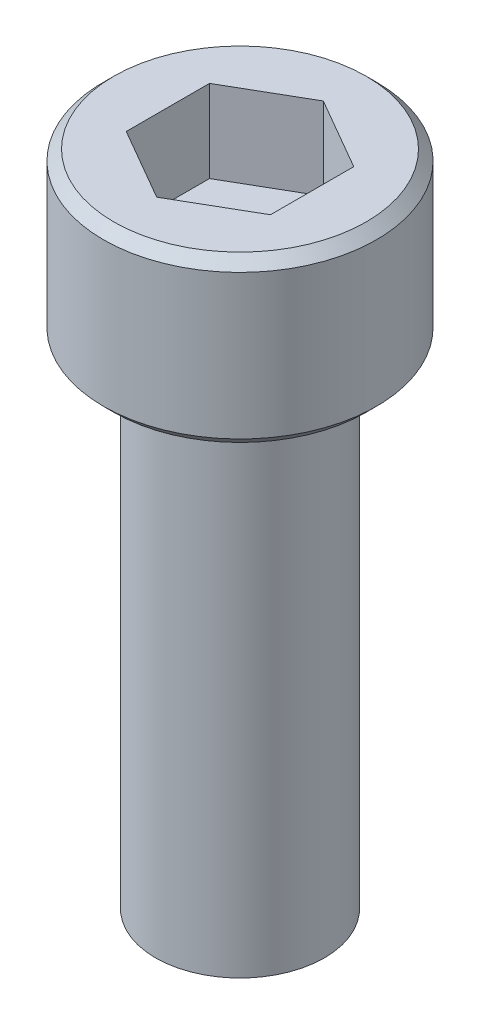
ISO-10303-21;
HEADER;
FILE_DESCRIPTION(('STEP AP214'),'2;1');
FILE_NAME('part.step','',(''),(''),'','','');
FILE_SCHEMA(('AUTOMOTIVE_DESIGN { 1 0 10303 214 1 1 1 1 }'));
ENDSEC;
DATA;
#1=APPLICATION_CONTEXT('core data for automotive mechanical design processes');
#2=APPLICATION_PROTOCOL_DEFINITION('international standard','automotive_design',2000,#1);
#3=PRODUCT_CONTEXT('',#1,'mechanical');
#4=PRODUCT('Part','Part','',(#3));
#5=PRODUCT_RELATED_PRODUCT_CATEGORY('part','',(#4));
#6=PRODUCT_DEFINITION_FORMATION('','',#4);
#7=PRODUCT_DEFINITION_CONTEXT('part definition',#1,'design');
#8=PRODUCT_DEFINITION('design','',#6,#7);
#9=PRODUCT_DEFINITION_SHAPE('','',#8);
#10=(LENGTH_UNIT() NAMED_UNIT(*) SI_UNIT(.MILLI.,.METRE.));
#11=(NAMED_UNIT(*) PLANE_ANGLE_UNIT() SI_UNIT($,.RADIAN.));
#12=(NAMED_UNIT(*) SI_UNIT($,.STERADIAN.) SOLID_ANGLE_UNIT());
#13=UNCERTAINTY_MEASURE_WITH_UNIT(LENGTH_MEASURE(1.E-05),#10,'distance_accuracy_value','');
#14=(GEOMETRIC_REPRESENTATION_CONTEXT(3) GLOBAL_UNCERTAINTY_ASSIGNED_CONTEXT((#13)) GLOBAL_UNIT_ASSIGNED_CONTEXT((#10,
#11,#12)) REPRESENTATION_CONTEXT('',''));
#15=CARTESIAN_POINT('',(0.,0.,0.));
#16=DIRECTION('',(0.,0.,1.));
#17=DIRECTION('',(1.,0.,0.));
#18=AXIS2_PLACEMENT_3D('',#15,#16,#17);
#19=CARTESIAN_POINT('',(1.778,2.03200000000001,3.07958633585744));
#20=DIRECTION('',(0.,1.,0.));
#21=DIRECTION('',(0.,0.,1.));
#22=AXIS2_PLACEMENT_3D('',#19,#20,#21);
#23=PLANE('',#22);
#24=DIRECTION('',(-0.866025403784439,0.,0.5));
#25=VECTOR('',#24,1.);
#26=CARTESIAN_POINT('',(0.,2.03200000000001,-2.05305755723829));
#27=LINE('',#26,#25);
#28=CARTESIAN_POINT('',(0.,2.03200000000001,-2.0530575572383));
#29=VERTEX_POINT('',#28);
#30=CARTESIAN_POINT('',(-1.778,2.03200000000001,-1.02652877861915));
#31=VERTEX_POINT('',#30);
#32=EDGE_CURVE('E67',#29,#31,#27,.T.);
#33=ORIENTED_EDGE('',*,*,#32,.T.);
#34=DIRECTION('',(0.,0.,1.));
#35=VECTOR('',#34,1.);
#36=CARTESIAN_POINT('',(-1.778,2.03200000000001,-1.02652877861915));
#37=LINE('',#36,#35);
#38=CARTESIAN_POINT('',(-1.778,2.03200000000001,1.02652877861915));
#39=VERTEX_POINT('',#38);
#40=EDGE_CURVE('E69',#31,#39,#37,.T.);
#41=ORIENTED_EDGE('',*,*,#40,.T.);
#42=DIRECTION('',(0.866025403784439,0.,0.499999999999999));
#43=VECTOR('',#42,1.);
#44=CARTESIAN_POINT('',(-1.77800000000001,2.03200000000001,1.02652877861915));
#45=LINE('',#44,#43);
#46=CARTESIAN_POINT('',(0.,2.03200000000001,2.05305755723831));
#47=VERTEX_POINT('',#46);
#48=EDGE_CURVE('E71',#39,#47,#45,.T.);
#49=ORIENTED_EDGE('',*,*,#48,.T.);
#50=DIRECTION('',(0.866025403784439,0.,-0.5));
#51=VECTOR('',#50,1.);
#52=CARTESIAN_POINT('',(0.,2.03200000000001,2.05305755723831));
#53=LINE('',#52,#51);
#54=CARTESIAN_POINT('',(1.77799999999999,2.03200000000001,1.02652877861915));
#55=VERTEX_POINT('',#54);
#56=EDGE_CURVE('E126',#47,#55,#53,.T.);
#57=ORIENTED_EDGE('',*,*,#56,.T.);
#58=DIRECTION('',(0.,0.,-1.));
#59=VECTOR('',#58,1.);
#60=CARTESIAN_POINT('',(1.77799999999999,2.03200000000001,1.02652877861915));
#61=LINE('',#60,#59);
#62=CARTESIAN_POINT('',(1.77799999999999,2.03200000000001,-1.02652877861916));
#63=VERTEX_POINT('',#62);
#64=EDGE_CURVE('E131',#55,#63,#61,.T.);
#65=ORIENTED_EDGE('',*,*,#64,.T.);
#66=DIRECTION('',(-0.866025403784439,0.,-0.5));
#67=VECTOR('',#66,1.);
#68=CARTESIAN_POINT('',(1.77799999999999,2.03200000000001,-1.02652877861916));
#69=LINE('',#68,#67);
#70=EDGE_CURVE('E135',#63,#29,#69,.T.);
#71=ORIENTED_EDGE('',*,*,#70,.T.);
#72=EDGE_LOOP('',(#33,#41,#49,#57,#65,#71));
#73=FACE_BOUND('',#72,.T.);
#74=ADVANCED_FACE('F16',(#73),#23,.T.);
#75=CARTESIAN_POINT('',(-1.77800000000001,2.03200000000001,1.02652877861915));
#76=DIRECTION('',(-0.499999999999999,0.,0.866025403784439));
#77=DIRECTION('',(0.866025403784439,0.,0.499999999999999));
#78=AXIS2_PLACEMENT_3D('',#75,#76,#77);
#79=PLANE('',#78);
#80=DIRECTION('',(0.,1.,0.));
#81=VECTOR('',#80,1.);
#82=CARTESIAN_POINT('',(0.,2.03200000000001,2.05305755723831));
#83=LINE('',#82,#81);
#84=CARTESIAN_POINT('',(0.,4.06400000000001,2.05305755723831));
#85=VERTEX_POINT('',#84);
#86=EDGE_CURVE('E82',#85,#47,#83,.F.);
#87=ORIENTED_EDGE('',*,*,#86,.T.);
#88=ORIENTED_EDGE('',*,*,#48,.F.);
#89=DIRECTION('',(0.,1.,0.));
#90=VECTOR('',#89,1.);
#91=CARTESIAN_POINT('',(-1.778,2.03200000000001,1.02652877861915));
#92=LINE('',#91,#90);
#93=CARTESIAN_POINT('',(-1.778,4.06400000000001,1.02652877861915));
#94=VERTEX_POINT('',#93);
#95=EDGE_CURVE('E76',#39,#94,#92,.T.);
#96=ORIENTED_EDGE('',*,*,#95,.T.);
#97=DIRECTION('',(-0.866025403784438,0.,-0.500000000000001));
#98=VECTOR('',#97,1.);
#99=CARTESIAN_POINT('',(0.,4.06400000000001,2.05305755723831));
#100=LINE('',#99,#98);
#101=EDGE_CURVE('E123',#85,#94,#100,.T.);
#102=ORIENTED_EDGE('',*,*,#101,.F.);
#103=EDGE_LOOP('',(#87,#88,#96,#102));
#104=FACE_BOUND('',#103,.T.);
#105=ADVANCED_FACE('F79',(#104),#79,.F.);
#106=CARTESIAN_POINT('',(-1.778,2.03200000000001,-1.02652877861915));
#107=DIRECTION('',(-1.,0.,0.));
#108=DIRECTION('',(0.,0.,1.));
#109=AXIS2_PLACEMENT_3D('',#106,#107,#108);
#110=PLANE('',#109);
#111=ORIENTED_EDGE('',*,*,#95,.F.);
#112=ORIENTED_EDGE('',*,*,#40,.F.);
#113=DIRECTION('',(0.,1.,0.));
#114=VECTOR('',#113,1.);
#115=CARTESIAN_POINT('',(-1.778,2.03200000000001,-1.02652877861914));
#116=LINE('',#115,#114);
#117=CARTESIAN_POINT('',(-1.778,4.06400000000001,-1.02652877861915));
#118=VERTEX_POINT('',#117);
#119=EDGE_CURVE('E90',#31,#118,#116,.T.);
#120=ORIENTED_EDGE('',*,*,#119,.T.);
#121=DIRECTION('',(0.,0.,1.));
#122=VECTOR('',#121,1.);
#123=CARTESIAN_POINT('',(-1.77800000000001,4.06400000000001,0.));
#124=LINE('',#123,#122);
#125=EDGE_CURVE('E87',#94,#118,#124,.F.);
#126=ORIENTED_EDGE('',*,*,#125,.F.);
#127=EDGE_LOOP('',(#111,#112,#120,#126));
#128=FACE_BOUND('',#127,.T.);
#129=ADVANCED_FACE('F85',(#128),#110,.F.);
#130=CARTESIAN_POINT('',(0.,2.03200000000001,-2.05305755723829));
#131=DIRECTION('',(-0.5,0.,-0.866025403784439));
#132=DIRECTION('',(-0.866025403784439,0.,0.5));
#133=AXIS2_PLACEMENT_3D('',#130,#131,#132);
#134=PLANE('',#133);
#135=ORIENTED_EDGE('',*,*,#119,.F.);
#136=ORIENTED_EDGE('',*,*,#32,.F.);
#137=DIRECTION('',(0.,1.,0.));
#138=VECTOR('',#137,1.);
#139=CARTESIAN_POINT('',(0.,2.03200000000001,-2.05305755723831));
#140=LINE('',#139,#138);
#141=CARTESIAN_POINT('',(0.,4.06400000000001,-2.0530575572383));
#142=VERTEX_POINT('',#141);
#143=EDGE_CURVE('E133',#29,#142,#140,.T.);
#144=ORIENTED_EDGE('',*,*,#143,.T.);
#145=DIRECTION('',(0.86602540378444,0.,-0.499999999999998));
#146=VECTOR('',#145,1.);
#147=CARTESIAN_POINT('',(-1.778,4.06400000000001,-1.02652877861915));
#148=LINE('',#147,#146);
#149=EDGE_CURVE('E119',#118,#142,#148,.T.);
#150=ORIENTED_EDGE('',*,*,#149,.F.);
#151=EDGE_LOOP('',(#135,#136,#144,#150));
#152=FACE_BOUND('',#151,.T.);
#153=ADVANCED_FACE('F138',(#152),#134,.F.);
#154=CARTESIAN_POINT('',(1.77799999999999,2.03200000000001,-1.02652877861916));
#155=DIRECTION('',(0.5,0.,-0.866025403784439));
#156=DIRECTION('',(-0.866025403784439,0.,-0.5));
#157=AXIS2_PLACEMENT_3D('',#154,#155,#156);
#158=PLANE('',#157);
#159=ORIENTED_EDGE('',*,*,#143,.F.);
#160=ORIENTED_EDGE('',*,*,#70,.F.);
#161=DIRECTION('',(0.,1.,0.));
#162=VECTOR('',#161,1.);
#163=CARTESIAN_POINT('',(1.77799999999999,2.03200000000001,-1.02652877861916));
#164=LINE('',#163,#162);
#165=CARTESIAN_POINT('',(1.77799999999999,4.06400000000001,-1.02652877861916));
#166=VERTEX_POINT('',#165);
#167=EDGE_CURVE('E129',#63,#166,#164,.T.);
#168=ORIENTED_EDGE('',*,*,#167,.T.);
#169=DIRECTION('',(0.866025403784443,0.,0.499999999999992));
#170=VECTOR('',#169,1.);
#171=CARTESIAN_POINT('',(0.,4.06400000000001,-2.05305755723829));
#172=LINE('',#171,#170);
#173=EDGE_CURVE('E116',#142,#166,#172,.T.);
#174=ORIENTED_EDGE('',*,*,#173,.F.);
#175=EDGE_LOOP('',(#159,#160,#168,#174));
#176=FACE_BOUND('',#175,.T.);
#177=ADVANCED_FACE('F150',(#176),#158,.F.);
#178=CARTESIAN_POINT('',(1.77799999999999,2.03200000000001,1.02652877861915));
#179=DIRECTION('',(1.,0.,0.));
#180=DIRECTION('',(0.,0.,-1.));
#181=AXIS2_PLACEMENT_3D('',#178,#179,#180);
#182=PLANE('',#181);
#183=ORIENTED_EDGE('',*,*,#167,.F.);
#184=ORIENTED_EDGE('',*,*,#64,.F.);
#185=DIRECTION('',(0.,1.,0.));
#186=VECTOR('',#185,1.);
#187=CARTESIAN_POINT('',(1.77799999999999,2.03200000000001,1.02652877861915));
#188=LINE('',#187,#186);
#189=CARTESIAN_POINT('',(1.77799999999999,4.06400000000001,1.02652877861915));
#190=VERTEX_POINT('',#189);
#191=EDGE_CURVE('E34',#55,#190,#188,.T.);
#192=ORIENTED_EDGE('',*,*,#191,.T.);
#193=DIRECTION('',(0.,0.,1.));
#194=VECTOR('',#193,1.);
#195=CARTESIAN_POINT('',(1.77799999999999,4.06400000000001,0.));
#196=LINE('',#195,#194);
#197=EDGE_CURVE('E113',#166,#190,#196,.T.);
#198=ORIENTED_EDGE('',*,*,#197,.F.);
#199=EDGE_LOOP('',(#183,#184,#192,#198));
#200=FACE_BOUND('',#199,.T.);
#201=ADVANCED_FACE('F148',(#200),#182,.F.);
#202=CARTESIAN_POINT('',(0.,2.03200000000001,2.05305755723831));
#203=DIRECTION('',(0.5,0.,0.866025403784439));
#204=DIRECTION('',(0.866025403784439,0.,-0.5));
#205=AXIS2_PLACEMENT_3D('',#202,#203,#204);
#206=PLANE('',#205);
#207=ORIENTED_EDGE('',*,*,#191,.F.);
#208=ORIENTED_EDGE('',*,*,#56,.F.);
#209=ORIENTED_EDGE('',*,*,#86,.F.);
#210=DIRECTION('',(-0.866025403784439,0.,0.499999999999999));
#211=VECTOR('',#210,1.);
#212=CARTESIAN_POINT('',(1.77799999999999,4.06400000000001,1.02652877861915));
#213=LINE('',#212,#211);
#214=EDGE_CURVE('E110',#190,#85,#213,.T.);
#215=ORIENTED_EDGE('',*,*,#214,.F.);
#216=EDGE_LOOP('',(#207,#208,#209,#215));
#217=FACE_BOUND('',#216,.T.);
#218=ADVANCED_FACE('F145',(#217),#206,.F.);
#219=CARTESIAN_POINT('',(0.,4.06400000000001,0.));
#220=DIRECTION('',(0.,1.,0.));
#221=DIRECTION('',(0.,0.,1.));
#222=AXIS2_PLACEMENT_3D('',#219,#220,#221);
#223=PLANE('',#222);
#224=ORIENTED_EDGE('',*,*,#197,.T.);
#225=ORIENTED_EDGE('',*,*,#214,.T.);
#226=ORIENTED_EDGE('',*,*,#101,.T.);
#227=ORIENTED_EDGE('',*,*,#125,.T.);
#228=ORIENTED_EDGE('',*,*,#149,.T.);
#229=ORIENTED_EDGE('',*,*,#173,.T.);
#230=EDGE_LOOP('',(#224,#225,#226,#227,#228,#229));
#231=FACE_BOUND('',#230,.T.);
#232=CARTESIAN_POINT('',(0.,4.06400000002805,0.));
#233=DIRECTION('',(0.,-1.,0.));
#234=DIRECTION('',(0.,0.,-1.));
#235=AXIS2_PLACEMENT_3D('',#232,#233,#234);
#236=CIRCLE('',#235,3.11150000004545);
#237=CARTESIAN_POINT('',(0.,4.06400000002805,-3.11150000004545));
#238=VERTEX_POINT('',#237);
#239=EDGE_CURVE('E19',#238,#238,#236,.T.);
#240=ORIENTED_EDGE('',*,*,#239,.F.);
#241=EDGE_LOOP('',(#240));
#242=FACE_BOUND('',#241,.T.);
#243=ADVANCED_FACE('F142',(#231,#242),#223,.T.);
#244=CARTESIAN_POINT('',(0.,3.80999999998721,0.));
#245=DIRECTION('',(0.,-1.,0.));
#246=DIRECTION('',(0.,0.,-1.));
#247=AXIS2_PLACEMENT_3D('',#244,#245,#246);
#248=CONICAL_SURFACE('',#247,3.36550000002944,0.785398163285552);
#249=ORIENTED_EDGE('',*,*,#239,.T.);
#250=EDGE_LOOP('',(#249));
#251=FACE_BOUND('',#250,.T.);
#252=CARTESIAN_POINT('',(0.,3.81000000000001,0.));
#253=DIRECTION('',(0.,-1.,0.));
#254=DIRECTION('',(0.,0.,-1.));
#255=AXIS2_PLACEMENT_3D('',#252,#253,#254);
#256=CIRCLE('',#255,3.3655);
#257=CARTESIAN_POINT('',(0.,3.81000000000001,-3.3655));
#258=VERTEX_POINT('',#257);
#259=EDGE_CURVE('E102',#258,#258,#256,.T.);
#260=ORIENTED_EDGE('',*,*,#259,.F.);
#261=EDGE_LOOP('',(#260));
#262=FACE_BOUND('',#261,.T.);
#263=ADVANCED_FACE('F187',(#251,#262),#248,.T.);
#264=CARTESIAN_POINT('',(0.,4.06400000000001,0.));
#265=DIRECTION('',(0.,-1.,0.));
#266=DIRECTION('',(0.,0.,-1.));
#267=AXIS2_PLACEMENT_3D('',#264,#265,#266);
#268=CYLINDRICAL_SURFACE('',#267,3.3655);
#269=ORIENTED_EDGE('',*,*,#259,.T.);
#270=EDGE_LOOP('',(#269));
#271=FACE_BOUND('',#270,.T.);
#272=CARTESIAN_POINT('',(0.,0.253999999983989,0.));
#273=DIRECTION('',(0.,1.,0.));
#274=DIRECTION('',(0.,0.,1.));
#275=AXIS2_PLACEMENT_3D('',#272,#273,#274);
#276=CIRCLE('',#275,3.3654999999726);
#277=CARTESIAN_POINT('',(0.,0.253999999983989,3.3654999999726));
#278=VERTEX_POINT('',#277);
#279=EDGE_CURVE('E98',#278,#278,#276,.F.);
#280=ORIENTED_EDGE('',*,*,#279,.F.);
#281=EDGE_LOOP('',(#280));
#282=FACE_BOUND('',#281,.T.);
#283=ADVANCED_FACE('F183',(#271,#282),#268,.T.);
#284=CARTESIAN_POINT('',(0.,-12.7,0.));
#285=DIRECTION('',(0.,1.,0.));
#286=DIRECTION('',(0.,0.,1.));
#287=AXIS2_PLACEMENT_3D('',#284,#285,#286);
#288=PLANE('',#287);
#289=CARTESIAN_POINT('',(0.,-12.6999999999953,0.));
#290=DIRECTION('',(0.,1.,0.));
#291=DIRECTION('',(-1.,0.,0.));
#292=AXIS2_PLACEMENT_3D('',#289,#290,#291);
#293=CIRCLE('',#292,1.31318000006786);
#294=CARTESIAN_POINT('',(-1.31318000006786,-12.6999999999953,0.));
#295=VERTEX_POINT('',#294);
#296=EDGE_CURVE('E96',#295,#295,#293,.T.);
#297=ORIENTED_EDGE('',*,*,#296,.F.);
#298=EDGE_LOOP('',(#297));
#299=FACE_BOUND('',#298,.T.);
#300=ADVANCED_FACE('F179',(#299),#288,.F.);
#301=CARTESIAN_POINT('',(0.,0.253999999983989,0.));
#302=DIRECTION('',(0.,1.,0.));
#303=DIRECTION('',(0.,0.,1.));
#304=AXIS2_PLACEMENT_3D('',#301,#302,#303);
#305=CONICAL_SURFACE('',#304,3.3654999999726,0.785398163397448);
#306=CARTESIAN_POINT('',(0.,0.,0.));
#307=DIRECTION('',(0.,1.,0.));
#308=DIRECTION('',(0.,0.,1.));
#309=AXIS2_PLACEMENT_3D('',#306,#307,#308);
#310=CIRCLE('',#309,3.11149999998861);
#311=CARTESIAN_POINT('',(0.,0.,3.11149999998861));
#312=VERTEX_POINT('',#311);
#313=EDGE_CURVE('E94',#312,#312,#310,.T.);
#314=ORIENTED_EDGE('',*,*,#313,.T.);
#315=EDGE_LOOP('',(#314));
#316=FACE_BOUND('',#315,.T.);
#317=ORIENTED_EDGE('',*,*,#279,.T.);
#318=EDGE_LOOP('',(#317));
#319=FACE_BOUND('',#318,.T.);
#320=ADVANCED_FACE('F175',(#316,#319),#305,.T.);
#321=CARTESIAN_POINT('',(0.,-12.1615200000633,0.));
#322=DIRECTION('',(0.,1.,0.));
#323=DIRECTION('',(-1.,0.,0.));
#324=AXIS2_PLACEMENT_3D('',#321,#322,#323);
#325=CONICAL_SURFACE('',#324,2.0827999999824,0.960291895417683);
#326=CARTESIAN_POINT('',(0.,-12.16152,0.));
#327=DIRECTION('',(0.,1.,0.));
#328=DIRECTION('',(0.,0.,1.));
#329=AXIS2_PLACEMENT_3D('',#326,#327,#328);
#330=CIRCLE('',#329,2.0828);
#331=CARTESIAN_POINT('',(0.,-12.16152,2.0828));
#332=VERTEX_POINT('',#331);
#333=EDGE_CURVE('E25',#332,#332,#330,.T.);
#334=ORIENTED_EDGE('',*,*,#333,.F.);
#335=EDGE_LOOP('',(#334));
#336=FACE_BOUND('',#335,.T.);
#337=ORIENTED_EDGE('',*,*,#296,.T.);
#338=EDGE_LOOP('',(#337));
#339=FACE_BOUND('',#338,.T.);
#340=ADVANCED_FACE('F168',(#336,#339),#325,.T.);
#341=CARTESIAN_POINT('',(0.,0.,0.));
#342=DIRECTION('',(0.,1.,0.));
#343=DIRECTION('',(0.,0.,1.));
#344=AXIS2_PLACEMENT_3D('',#341,#342,#343);
#345=PLANE('',#344);
#346=CARTESIAN_POINT('',(0.,0.,0.));
#347=DIRECTION('',(0.,1.,0.));
#348=DIRECTION('',(0.,0.,1.));
#349=AXIS2_PLACEMENT_3D('',#346,#347,#348);
#350=CIRCLE('',#349,2.0828);
#351=CARTESIAN_POINT('',(0.,0.,2.0828));
#352=VERTEX_POINT('',#351);
#353=EDGE_CURVE('E11',#352,#352,#350,.F.);
#354=ORIENTED_EDGE('',*,*,#353,.F.);
#355=EDGE_LOOP('',(#354));
#356=FACE_BOUND('',#355,.T.);
#357=ORIENTED_EDGE('',*,*,#313,.F.);
#358=EDGE_LOOP('',(#357));
#359=FACE_BOUND('',#358,.T.);
#360=ADVANCED_FACE('F162',(#356,#359),#345,.F.);
#361=CARTESIAN_POINT('',(0.,-12.7,0.));
#362=DIRECTION('',(0.,1.,0.));
#363=DIRECTION('',(0.,0.,1.));
#364=AXIS2_PLACEMENT_3D('',#361,#362,#363);
#365=CYLINDRICAL_SURFACE('',#364,2.0828);
#366=ORIENTED_EDGE('',*,*,#353,.T.);
#367=EDGE_LOOP('',(#366));
#368=FACE_BOUND('',#367,.T.);
#369=ORIENTED_EDGE('',*,*,#333,.T.);
#370=EDGE_LOOP('',(#369));
#371=FACE_BOUND('',#370,.T.);
#372=ADVANCED_FACE('F160',(#368,#371),#365,.T.);
#373=CLOSED_SHELL('',(#74,#105,#129,#153,#177,#201,#218,#243,#263,#283,#300,#320,#340,#360,#372));
#374=MANIFOLD_SOLID_BREP('B1',#373);
#375=ADVANCED_BREP_SHAPE_REPRESENTATION('',(#18,#374),#14);
#376=SHAPE_DEFINITION_REPRESENTATION(#9,#375);
ENDSEC;
END-ISO-10303-21;
